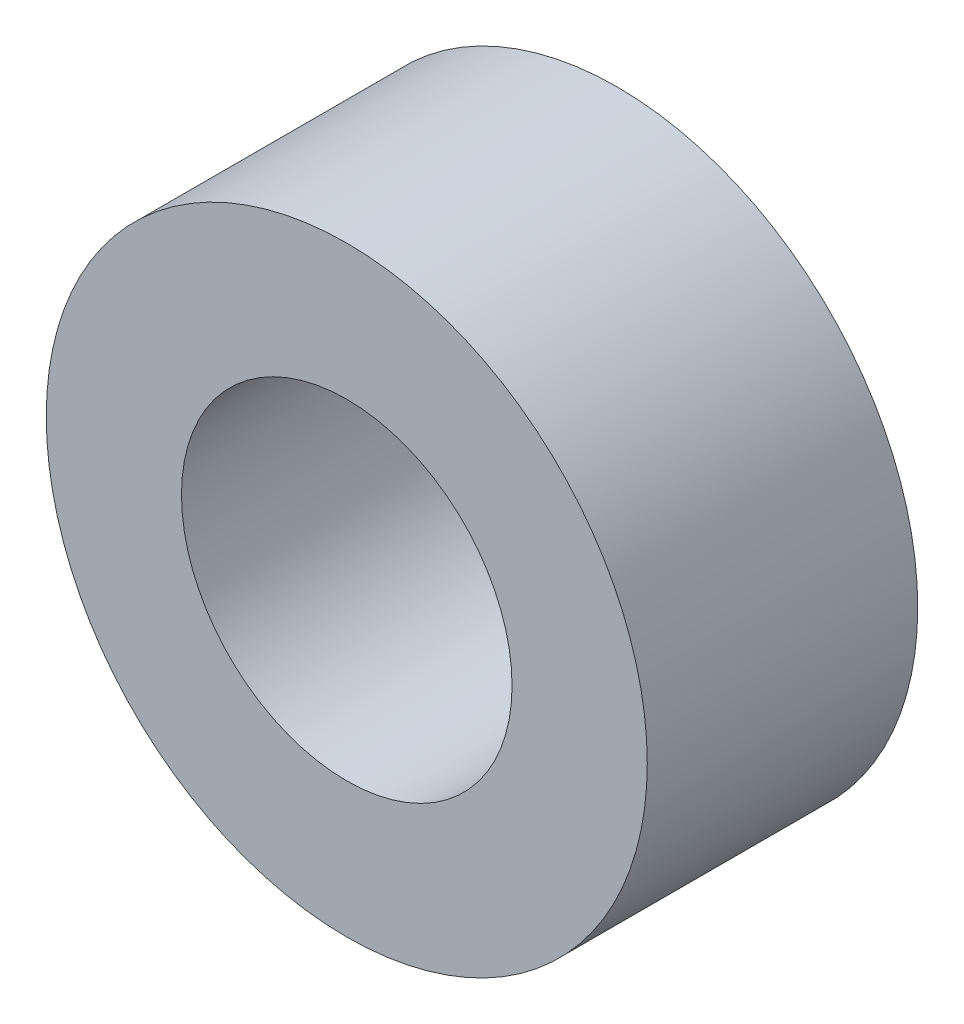
ISO-10303-21;
HEADER;
FILE_DESCRIPTION(('STEP AP214'),'2;1');
FILE_NAME('part.step','',(''),(''),'','','');
FILE_SCHEMA(('AUTOMOTIVE_DESIGN { 1 0 10303 214 1 1 1 1 }'));
ENDSEC;
DATA;
#1=APPLICATION_CONTEXT('core data for automotive mechanical design processes');
#2=APPLICATION_PROTOCOL_DEFINITION('international standard','automotive_design',2000,#1);
#3=PRODUCT_CONTEXT('',#1,'mechanical');
#4=PRODUCT('Part','Part','',(#3));
#5=PRODUCT_RELATED_PRODUCT_CATEGORY('part','',(#4));
#6=PRODUCT_DEFINITION_FORMATION('','',#4);
#7=PRODUCT_DEFINITION_CONTEXT('part definition',#1,'design');
#8=PRODUCT_DEFINITION('design','',#6,#7);
#9=PRODUCT_DEFINITION_SHAPE('','',#8);
#10=(LENGTH_UNIT() NAMED_UNIT(*) SI_UNIT(.MILLI.,.METRE.));
#11=(NAMED_UNIT(*) PLANE_ANGLE_UNIT() SI_UNIT($,.RADIAN.));
#12=(NAMED_UNIT(*) SI_UNIT($,.STERADIAN.) SOLID_ANGLE_UNIT());
#13=UNCERTAINTY_MEASURE_WITH_UNIT(LENGTH_MEASURE(1.E-05),#10,'distance_accuracy_value','');
#14=(GEOMETRIC_REPRESENTATION_CONTEXT(3) GLOBAL_UNCERTAINTY_ASSIGNED_CONTEXT((#13)) GLOBAL_UNIT_ASSIGNED_CONTEXT((#10,
#11,#12)) REPRESENTATION_CONTEXT('',''));
#15=CARTESIAN_POINT('',(0.,0.,0.));
#16=DIRECTION('',(0.,0.,1.));
#17=DIRECTION('',(1.,0.,0.));
#18=AXIS2_PLACEMENT_3D('',#15,#16,#17);
#19=CARTESIAN_POINT('',(0.,0.,4.5));
#20=DIRECTION('',(0.,0.,-1.));
#21=DIRECTION('',(-1.,0.,0.));
#22=AXIS2_PLACEMENT_3D('',#19,#20,#21);
#23=CYLINDRICAL_SURFACE('',#22,5.);
#24=CARTESIAN_POINT('',(0.,0.,4.5));
#25=DIRECTION('',(0.,0.,1.));
#26=DIRECTION('',(1.,0.,0.));
#27=AXIS2_PLACEMENT_3D('',#24,#25,#26);
#28=CIRCLE('',#27,5.);
#29=CARTESIAN_POINT('',(5.,0.,4.5));
#30=VERTEX_POINT('',#29);
#31=EDGE_CURVE('E10',#30,#30,#28,.T.);
#32=ORIENTED_EDGE('',*,*,#31,.F.);
#33=EDGE_LOOP('',(#32));
#34=FACE_BOUND('',#33,.T.);
#35=CARTESIAN_POINT('',(0.,0.,0.));
#36=DIRECTION('',(0.,0.,1.));
#37=DIRECTION('',(1.,0.,0.));
#38=AXIS2_PLACEMENT_3D('',#35,#36,#37);
#39=CIRCLE('',#38,5.);
#40=CARTESIAN_POINT('',(5.,0.,0.));
#41=VERTEX_POINT('',#40);
#42=EDGE_CURVE('E40',#41,#41,#39,.T.);
#43=ORIENTED_EDGE('',*,*,#42,.T.);
#44=EDGE_LOOP('',(#43));
#45=FACE_BOUND('',#44,.T.);
#46=ADVANCED_FACE('F37',(#34,#45),#23,.T.);
#47=CARTESIAN_POINT('',(0.,0.,4.5));
#48=DIRECTION('',(0.,0.,1.));
#49=DIRECTION('',(1.,0.,0.));
#50=AXIS2_PLACEMENT_3D('',#47,#48,#49);
#51=PLANE('',#50);
#52=CARTESIAN_POINT('',(0.,0.,4.5));
#53=DIRECTION('',(0.,0.,1.));
#54=DIRECTION('',(1.,0.,0.));
#55=AXIS2_PLACEMENT_3D('',#52,#53,#54);
#56=CIRCLE('',#55,2.75);
#57=CARTESIAN_POINT('',(2.75,0.,4.5));
#58=VERTEX_POINT('',#57);
#59=EDGE_CURVE('E54',#58,#58,#56,.T.);
#60=ORIENTED_EDGE('',*,*,#59,.F.);
#61=EDGE_LOOP('',(#60));
#62=FACE_BOUND('',#61,.T.);
#63=ORIENTED_EDGE('',*,*,#31,.T.);
#64=EDGE_LOOP('',(#63));
#65=FACE_BOUND('',#64,.T.);
#66=ADVANCED_FACE('F62',(#62,#65),#51,.T.);
#67=CARTESIAN_POINT('',(0.,0.,0.));
#68=DIRECTION('',(0.,0.,1.));
#69=DIRECTION('',(1.,0.,0.));
#70=AXIS2_PLACEMENT_3D('',#67,#68,#69);
#71=PLANE('',#70);
#72=CARTESIAN_POINT('',(0.,0.,0.));
#73=DIRECTION('',(0.,0.,1.));
#74=DIRECTION('',(1.,0.,0.));
#75=AXIS2_PLACEMENT_3D('',#72,#73,#74);
#76=CIRCLE('',#75,2.75);
#77=CARTESIAN_POINT('',(2.75,0.,0.));
#78=VERTEX_POINT('',#77);
#79=EDGE_CURVE('E49',#78,#78,#76,.F.);
#80=ORIENTED_EDGE('',*,*,#79,.F.);
#81=EDGE_LOOP('',(#80));
#82=FACE_BOUND('',#81,.T.);
#83=ORIENTED_EDGE('',*,*,#42,.F.);
#84=EDGE_LOOP('',(#83));
#85=FACE_BOUND('',#84,.T.);
#86=ADVANCED_FACE('F64',(#82,#85),#71,.F.);
#87=CARTESIAN_POINT('',(0.,0.,-0.00100000000000013));
#88=DIRECTION('',(0.,0.,1.));
#89=DIRECTION('',(1.,0.,0.));
#90=AXIS2_PLACEMENT_3D('',#87,#88,#89);
#91=CYLINDRICAL_SURFACE('',#90,2.75);
#92=ORIENTED_EDGE('',*,*,#59,.T.);
#93=EDGE_LOOP('',(#92));
#94=FACE_BOUND('',#93,.T.);
#95=ORIENTED_EDGE('',*,*,#79,.T.);
#96=EDGE_LOOP('',(#95));
#97=FACE_BOUND('',#96,.T.);
#98=ADVANCED_FACE('F59',(#94,#97),#91,.F.);
#99=CLOSED_SHELL('',(#46,#66,#86,#98));
#100=MANIFOLD_SOLID_BREP('B2',#99);
#101=ADVANCED_BREP_SHAPE_REPRESENTATION('',(#18,#100),#14);
#102=SHAPE_DEFINITION_REPRESENTATION(#9,#101);
ENDSEC;
END-ISO-10303-21;
